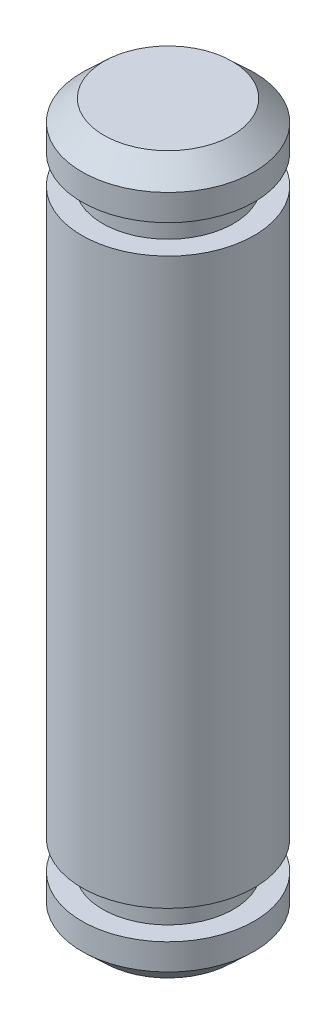
ISO-10303-21;
HEADER;
FILE_DESCRIPTION(('STEP AP214'),'2;1');
FILE_NAME('part.step','',(''),(''),'','','');
FILE_SCHEMA(('AUTOMOTIVE_DESIGN { 1 0 10303 214 1 1 1 1 }'));
ENDSEC;
DATA;
#1=APPLICATION_CONTEXT('core data for automotive mechanical design processes');
#2=APPLICATION_PROTOCOL_DEFINITION('international standard','automotive_design',2000,#1);
#3=PRODUCT_CONTEXT('',#1,'mechanical');
#4=PRODUCT('Part','Part','',(#3));
#5=PRODUCT_RELATED_PRODUCT_CATEGORY('part','',(#4));
#6=PRODUCT_DEFINITION_FORMATION('','',#4);
#7=PRODUCT_DEFINITION_CONTEXT('part definition',#1,'design');
#8=PRODUCT_DEFINITION('design','',#6,#7);
#9=PRODUCT_DEFINITION_SHAPE('','',#8);
#10=(LENGTH_UNIT() NAMED_UNIT(*) SI_UNIT(.MILLI.,.METRE.));
#11=(NAMED_UNIT(*) PLANE_ANGLE_UNIT() SI_UNIT($,.RADIAN.));
#12=(NAMED_UNIT(*) SI_UNIT($,.STERADIAN.) SOLID_ANGLE_UNIT());
#13=UNCERTAINTY_MEASURE_WITH_UNIT(LENGTH_MEASURE(1.E-05),#10,'distance_accuracy_value','');
#14=(GEOMETRIC_REPRESENTATION_CONTEXT(3) GLOBAL_UNCERTAINTY_ASSIGNED_CONTEXT((#13)) GLOBAL_UNIT_ASSIGNED_CONTEXT((#10,
#11,#12)) REPRESENTATION_CONTEXT('',''));
#15=CARTESIAN_POINT('',(0.,0.,0.));
#16=DIRECTION('',(0.,0.,1.));
#17=DIRECTION('',(1.,0.,0.));
#18=AXIS2_PLACEMENT_3D('',#15,#16,#17);
#19=CARTESIAN_POINT('',(-1.5875,5.207,0.));
#20=DIRECTION('',(0.,-1.,0.));
#21=DIRECTION('',(0.,0.,-1.));
#22=AXIS2_PLACEMENT_3D('',#19,#20,#21);
#23=PLANE('',#22);
#24=CARTESIAN_POINT('',(0.,5.207,0.));
#25=DIRECTION('',(0.,-1.,0.));
#26=DIRECTION('',(0.,0.,-1.));
#27=AXIS2_PLACEMENT_3D('',#24,#25,#26);
#28=CIRCLE('',#27,1.5875);
#29=CARTESIAN_POINT('',(0.,5.207,-1.5875));
#30=VERTEX_POINT('',#29);
#31=EDGE_CURVE('E10',#30,#30,#28,.T.);
#32=ORIENTED_EDGE('',*,*,#31,.F.);
#33=EDGE_LOOP('',(#32));
#34=FACE_BOUND('',#33,.T.);
#35=CARTESIAN_POINT('',(0.,5.207,0.));
#36=DIRECTION('',(0.,-1.,0.));
#37=DIRECTION('',(0.,0.,-1.));
#38=AXIS2_PLACEMENT_3D('',#35,#36,#37);
#39=CIRCLE('',#38,1.2065);
#40=CARTESIAN_POINT('',(0.,5.207,-1.2065));
#41=VERTEX_POINT('',#40);
#42=EDGE_CURVE('E70',#41,#41,#39,.T.);
#43=ORIENTED_EDGE('',*,*,#42,.T.);
#44=EDGE_LOOP('',(#43));
#45=FACE_BOUND('',#44,.T.);
#46=ADVANCED_FACE('F30',(#34,#45),#23,.F.);
#47=CARTESIAN_POINT('',(0.,0.,0.));
#48=DIRECTION('',(0.,-1.,0.));
#49=DIRECTION('',(0.,0.,-1.));
#50=AXIS2_PLACEMENT_3D('',#47,#48,#49);
#51=CYLINDRICAL_SURFACE('',#50,1.5875);
#52=CARTESIAN_POINT('',(0.,-5.207,0.));
#53=DIRECTION('',(0.,-1.,0.));
#54=DIRECTION('',(0.,0.,-1.));
#55=AXIS2_PLACEMENT_3D('',#52,#53,#54);
#56=CIRCLE('',#55,1.5875);
#57=CARTESIAN_POINT('',(0.,-5.207,-1.5875));
#58=VERTEX_POINT('',#57);
#59=EDGE_CURVE('E36',#58,#58,#56,.T.);
#60=ORIENTED_EDGE('',*,*,#59,.F.);
#61=EDGE_LOOP('',(#60));
#62=FACE_BOUND('',#61,.T.);
#63=ORIENTED_EDGE('',*,*,#31,.T.);
#64=EDGE_LOOP('',(#63));
#65=FACE_BOUND('',#64,.T.);
#66=ADVANCED_FACE('F110',(#62,#65),#51,.T.);
#67=CARTESIAN_POINT('',(-1.5875,-5.207,0.));
#68=DIRECTION('',(0.,1.,0.));
#69=DIRECTION('',(0.,0.,1.));
#70=AXIS2_PLACEMENT_3D('',#67,#68,#69);
#71=PLANE('',#70);
#72=CARTESIAN_POINT('',(0.,-5.207,0.));
#73=DIRECTION('',(0.,-1.,0.));
#74=DIRECTION('',(0.,0.,-1.));
#75=AXIS2_PLACEMENT_3D('',#72,#73,#74);
#76=CIRCLE('',#75,1.2065);
#77=CARTESIAN_POINT('',(0.,-5.207,-1.2065));
#78=VERTEX_POINT('',#77);
#79=EDGE_CURVE('E40',#78,#78,#76,.T.);
#80=ORIENTED_EDGE('',*,*,#79,.F.);
#81=EDGE_LOOP('',(#80));
#82=FACE_BOUND('',#81,.T.);
#83=ORIENTED_EDGE('',*,*,#59,.T.);
#84=EDGE_LOOP('',(#83));
#85=FACE_BOUND('',#84,.T.);
#86=ADVANCED_FACE('F115',(#82,#85),#71,.F.);
#87=CARTESIAN_POINT('',(0.,0.,0.));
#88=DIRECTION('',(0.,-1.,0.));
#89=DIRECTION('',(0.,0.,-1.));
#90=AXIS2_PLACEMENT_3D('',#87,#88,#89);
#91=CYLINDRICAL_SURFACE('',#90,1.2065);
#92=CARTESIAN_POINT('',(0.,-5.7404,0.));
#93=DIRECTION('',(0.,-1.,0.));
#94=DIRECTION('',(0.,0.,-1.));
#95=AXIS2_PLACEMENT_3D('',#92,#93,#94);
#96=CIRCLE('',#95,1.2065);
#97=CARTESIAN_POINT('',(0.,-5.7404,-1.2065));
#98=VERTEX_POINT('',#97);
#99=EDGE_CURVE('E44',#98,#98,#96,.T.);
#100=ORIENTED_EDGE('',*,*,#99,.F.);
#101=EDGE_LOOP('',(#100));
#102=FACE_BOUND('',#101,.T.);
#103=ORIENTED_EDGE('',*,*,#79,.T.);
#104=EDGE_LOOP('',(#103));
#105=FACE_BOUND('',#104,.T.);
#106=ADVANCED_FACE('F120',(#102,#105),#91,.T.);
#107=CARTESIAN_POINT('',(-1.2065,-5.7404,0.));
#108=DIRECTION('',(0.,-1.,0.));
#109=DIRECTION('',(0.,0.,-1.));
#110=AXIS2_PLACEMENT_3D('',#107,#108,#109);
#111=PLANE('',#110);
#112=CARTESIAN_POINT('',(0.,-5.7404,0.));
#113=DIRECTION('',(0.,-1.,0.));
#114=DIRECTION('',(0.,0.,-1.));
#115=AXIS2_PLACEMENT_3D('',#112,#113,#114);
#116=CIRCLE('',#115,1.5875);
#117=CARTESIAN_POINT('',(0.,-5.7404,-1.5875));
#118=VERTEX_POINT('',#117);
#119=EDGE_CURVE('E49',#118,#118,#116,.T.);
#120=ORIENTED_EDGE('',*,*,#119,.F.);
#121=EDGE_LOOP('',(#120));
#122=FACE_BOUND('',#121,.T.);
#123=ORIENTED_EDGE('',*,*,#99,.T.);
#124=EDGE_LOOP('',(#123));
#125=FACE_BOUND('',#124,.T.);
#126=ADVANCED_FACE('F126',(#122,#125),#111,.F.);
#127=CARTESIAN_POINT('',(0.,0.,0.));
#128=DIRECTION('',(0.,-1.,0.));
#129=DIRECTION('',(0.,0.,-1.));
#130=AXIS2_PLACEMENT_3D('',#127,#128,#129);
#131=CYLINDRICAL_SURFACE('',#130,1.5875);
#132=CARTESIAN_POINT('',(0.,-6.223,0.));
#133=DIRECTION('',(0.,-1.,0.));
#134=DIRECTION('',(0.,0.,-1.));
#135=AXIS2_PLACEMENT_3D('',#132,#133,#134);
#136=CIRCLE('',#135,1.5875);
#137=CARTESIAN_POINT('',(0.,-6.223,-1.5875));
#138=VERTEX_POINT('',#137);
#139=EDGE_CURVE('E52',#138,#138,#136,.T.);
#140=ORIENTED_EDGE('',*,*,#139,.F.);
#141=EDGE_LOOP('',(#140));
#142=FACE_BOUND('',#141,.T.);
#143=ORIENTED_EDGE('',*,*,#119,.T.);
#144=EDGE_LOOP('',(#143));
#145=FACE_BOUND('',#144,.T.);
#146=ADVANCED_FACE('F130',(#142,#145),#131,.T.);
#147=CARTESIAN_POINT('',(0.,-6.223,0.));
#148=DIRECTION('',(0.,1.,0.));
#149=DIRECTION('',(0.,0.,1.));
#150=AXIS2_PLACEMENT_3D('',#147,#148,#149);
#151=CONICAL_SURFACE('',#150,1.5875,0.815568544068997);
#152=CARTESIAN_POINT('',(0.,-6.604,0.));
#153=DIRECTION('',(0.,-1.,0.));
#154=DIRECTION('',(0.,0.,-1.));
#155=AXIS2_PLACEMENT_3D('',#152,#153,#154);
#156=CIRCLE('',#155,1.18278756142947);
#157=CARTESIAN_POINT('',(0.,-6.604,-1.18278756142947));
#158=VERTEX_POINT('',#157);
#159=EDGE_CURVE('E55',#158,#158,#156,.T.);
#160=ORIENTED_EDGE('',*,*,#159,.F.);
#161=EDGE_LOOP('',(#160));
#162=FACE_BOUND('',#161,.T.);
#163=ORIENTED_EDGE('',*,*,#139,.T.);
#164=EDGE_LOOP('',(#163));
#165=FACE_BOUND('',#164,.T.);
#166=ADVANCED_FACE('F106',(#162,#165),#151,.T.);
#167=CARTESIAN_POINT('',(-1.18278756142947,-6.604,0.));
#168=DIRECTION('',(0.,1.,0.));
#169=DIRECTION('',(0.,0.,1.));
#170=AXIS2_PLACEMENT_3D('',#167,#168,#169);
#171=PLANE('',#170);
#172=ORIENTED_EDGE('',*,*,#159,.T.);
#173=EDGE_LOOP('',(#172));
#174=FACE_BOUND('',#173,.T.);
#175=ADVANCED_FACE('F101',(#174),#171,.F.);
#176=CARTESIAN_POINT('',(-1.18278756142947,6.604,0.));
#177=DIRECTION('',(0.,-1.,0.));
#178=DIRECTION('',(0.,0.,-1.));
#179=AXIS2_PLACEMENT_3D('',#176,#177,#178);
#180=PLANE('',#179);
#181=CARTESIAN_POINT('',(0.,6.604,0.));
#182=DIRECTION('',(0.,-1.,0.));
#183=DIRECTION('',(0.,0.,-1.));
#184=AXIS2_PLACEMENT_3D('',#181,#182,#183);
#185=CIRCLE('',#184,1.18278756142947);
#186=CARTESIAN_POINT('',(0.,6.604,-1.18278756142947));
#187=VERTEX_POINT('',#186);
#188=EDGE_CURVE('E58',#187,#187,#185,.T.);
#189=ORIENTED_EDGE('',*,*,#188,.F.);
#190=EDGE_LOOP('',(#189));
#191=FACE_BOUND('',#190,.T.);
#192=ADVANCED_FACE('F96',(#191),#180,.F.);
#193=CARTESIAN_POINT('',(0.,6.604,0.));
#194=DIRECTION('',(0.,-1.,0.));
#195=DIRECTION('',(0.,0.,-1.));
#196=AXIS2_PLACEMENT_3D('',#193,#194,#195);
#197=CONICAL_SURFACE('',#196,1.18278756142947,0.815568544068997);
#198=CARTESIAN_POINT('',(0.,6.223,0.));
#199=DIRECTION('',(0.,-1.,0.));
#200=DIRECTION('',(0.,0.,-1.));
#201=AXIS2_PLACEMENT_3D('',#198,#199,#200);
#202=CIRCLE('',#201,1.5875);
#203=CARTESIAN_POINT('',(0.,6.223,-1.5875));
#204=VERTEX_POINT('',#203);
#205=EDGE_CURVE('E61',#204,#204,#202,.T.);
#206=ORIENTED_EDGE('',*,*,#205,.F.);
#207=EDGE_LOOP('',(#206));
#208=FACE_BOUND('',#207,.T.);
#209=ORIENTED_EDGE('',*,*,#188,.T.);
#210=EDGE_LOOP('',(#209));
#211=FACE_BOUND('',#210,.T.);
#212=ADVANCED_FACE('F90',(#208,#211),#197,.T.);
#213=CARTESIAN_POINT('',(0.,0.,0.));
#214=DIRECTION('',(0.,-1.,0.));
#215=DIRECTION('',(0.,0.,-1.));
#216=AXIS2_PLACEMENT_3D('',#213,#214,#215);
#217=CYLINDRICAL_SURFACE('',#216,1.5875);
#218=CARTESIAN_POINT('',(0.,5.7404,0.));
#219=DIRECTION('',(0.,-1.,0.));
#220=DIRECTION('',(0.,0.,-1.));
#221=AXIS2_PLACEMENT_3D('',#218,#219,#220);
#222=CIRCLE('',#221,1.5875);
#223=CARTESIAN_POINT('',(0.,5.7404,-1.5875));
#224=VERTEX_POINT('',#223);
#225=EDGE_CURVE('E64',#224,#224,#222,.T.);
#226=ORIENTED_EDGE('',*,*,#225,.F.);
#227=EDGE_LOOP('',(#226));
#228=FACE_BOUND('',#227,.T.);
#229=ORIENTED_EDGE('',*,*,#205,.T.);
#230=EDGE_LOOP('',(#229));
#231=FACE_BOUND('',#230,.T.);
#232=ADVANCED_FACE('F84',(#228,#231),#217,.T.);
#233=CARTESIAN_POINT('',(-1.2065,5.7404,0.));
#234=DIRECTION('',(0.,1.,0.));
#235=DIRECTION('',(0.,0.,1.));
#236=AXIS2_PLACEMENT_3D('',#233,#234,#235);
#237=PLANE('',#236);
#238=CARTESIAN_POINT('',(0.,5.7404,0.));
#239=DIRECTION('',(0.,-1.,0.));
#240=DIRECTION('',(0.,0.,-1.));
#241=AXIS2_PLACEMENT_3D('',#238,#239,#240);
#242=CIRCLE('',#241,1.2065);
#243=CARTESIAN_POINT('',(0.,5.7404,-1.2065));
#244=VERTEX_POINT('',#243);
#245=EDGE_CURVE('E67',#244,#244,#242,.T.);
#246=ORIENTED_EDGE('',*,*,#245,.F.);
#247=EDGE_LOOP('',(#246));
#248=FACE_BOUND('',#247,.T.);
#249=ORIENTED_EDGE('',*,*,#225,.T.);
#250=EDGE_LOOP('',(#249));
#251=FACE_BOUND('',#250,.T.);
#252=ADVANCED_FACE('F78',(#248,#251),#237,.F.);
#253=CARTESIAN_POINT('',(0.,0.,0.));
#254=DIRECTION('',(0.,-1.,0.));
#255=DIRECTION('',(0.,0.,-1.));
#256=AXIS2_PLACEMENT_3D('',#253,#254,#255);
#257=CYLINDRICAL_SURFACE('',#256,1.2065);
#258=ORIENTED_EDGE('',*,*,#42,.F.);
#259=EDGE_LOOP('',(#258));
#260=FACE_BOUND('',#259,.T.);
#261=ORIENTED_EDGE('',*,*,#245,.T.);
#262=EDGE_LOOP('',(#261));
#263=FACE_BOUND('',#262,.T.);
#264=ADVANCED_FACE('F75',(#260,#263),#257,.T.);
#265=CLOSED_SHELL('',(#46,#66,#86,#106,#126,#146,#166,#175,#192,#212,#232,#252,#264));
#266=MANIFOLD_SOLID_BREP('B2',#265);
#267=ADVANCED_BREP_SHAPE_REPRESENTATION('',(#18,#266),#14);
#268=SHAPE_DEFINITION_REPRESENTATION(#9,#267);
ENDSEC;
END-ISO-10303-21;
